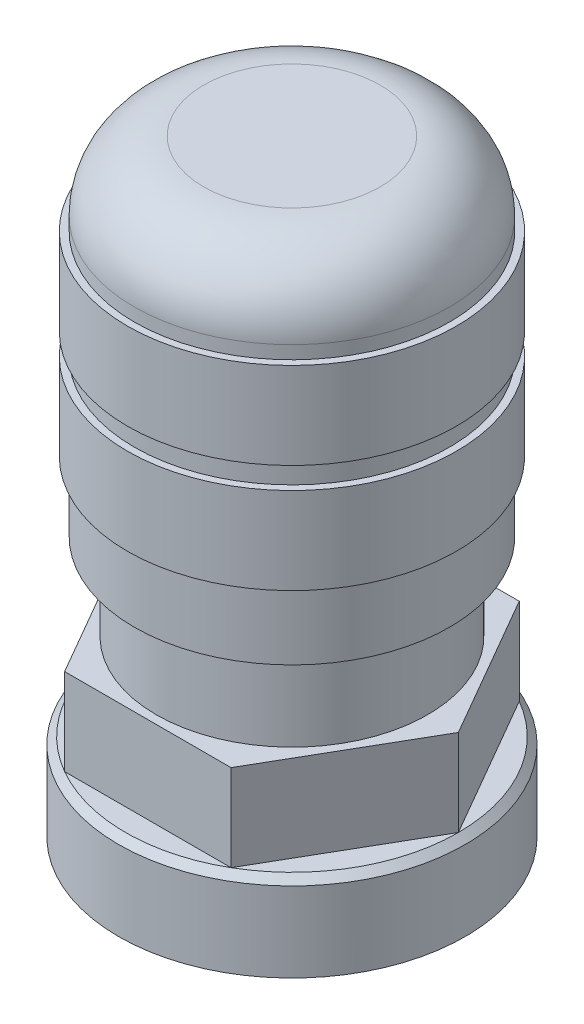
ISO-10303-21;
HEADER;
FILE_DESCRIPTION(('STEP AP214'),'2;1');
FILE_NAME('part.step','',(''),(''),'','','');
FILE_SCHEMA(('AUTOMOTIVE_DESIGN { 1 0 10303 214 1 1 1 1 }'));
ENDSEC;
DATA;
#1=APPLICATION_CONTEXT('core data for automotive mechanical design processes');
#2=APPLICATION_PROTOCOL_DEFINITION('international standard','automotive_design',2000,#1);
#3=PRODUCT_CONTEXT('',#1,'mechanical');
#4=PRODUCT('Part','Part','',(#3));
#5=PRODUCT_RELATED_PRODUCT_CATEGORY('part','',(#4));
#6=PRODUCT_DEFINITION_FORMATION('','',#4);
#7=PRODUCT_DEFINITION_CONTEXT('part definition',#1,'design');
#8=PRODUCT_DEFINITION('design','',#6,#7);
#9=PRODUCT_DEFINITION_SHAPE('','',#8);
#10=(LENGTH_UNIT() NAMED_UNIT(*) SI_UNIT(.MILLI.,.METRE.));
#11=(NAMED_UNIT(*) PLANE_ANGLE_UNIT() SI_UNIT($,.RADIAN.));
#12=(NAMED_UNIT(*) SI_UNIT($,.STERADIAN.) SOLID_ANGLE_UNIT());
#13=UNCERTAINTY_MEASURE_WITH_UNIT(LENGTH_MEASURE(1.E-05),#10,'distance_accuracy_value','');
#14=(GEOMETRIC_REPRESENTATION_CONTEXT(3) GLOBAL_UNCERTAINTY_ASSIGNED_CONTEXT((#13)) GLOBAL_UNIT_ASSIGNED_CONTEXT((#10,
#11,#12)) REPRESENTATION_CONTEXT('',''));
#15=CARTESIAN_POINT('',(0.,0.,0.));
#16=DIRECTION('',(0.,0.,1.));
#17=DIRECTION('',(1.,0.,0.));
#18=AXIS2_PLACEMENT_3D('',#15,#16,#17);
#19=CARTESIAN_POINT('',(0.,17.78,3.23260615340587));
#20=DIRECTION('',(0.,-1.,0.));
#21=DIRECTION('',(0.,0.,-1.));
#22=AXIS2_PLACEMENT_3D('',#19,#20,#21);
#23=PLANE('',#22);
#24=CARTESIAN_POINT('',(0.,17.78,0.));
#25=DIRECTION('',(0.,1.,0.));
#26=DIRECTION('',(0.,0.,1.));
#27=AXIS2_PLACEMENT_3D('',#24,#25,#26);
#28=CIRCLE('',#27,3.23260615340587);
#29=CARTESIAN_POINT('',(0.,17.78,3.23260615340587));
#30=VERTEX_POINT('',#29);
#31=EDGE_CURVE('E223',#30,#30,#28,.T.);
#32=ORIENTED_EDGE('',*,*,#31,.F.);
#33=EDGE_LOOP('',(#32));
#34=FACE_BOUND('',#33,.T.);
#35=ADVANCED_FACE('F36',(#34),#23,.T.);
#36=CARTESIAN_POINT('',(0.,16.51,0.));
#37=DIRECTION('',(0.,1.,0.));
#38=DIRECTION('',(0.,0.,1.));
#39=AXIS2_PLACEMENT_3D('',#36,#37,#38);
#40=TOROIDAL_SURFACE('',#39,3.23260615340588,1.27);
#41=ORIENTED_EDGE('',*,*,#31,.T.);
#42=EDGE_LOOP('',(#41));
#43=FACE_BOUND('',#42,.T.);
#44=CARTESIAN_POINT('',(0.,16.51,0.));
#45=DIRECTION('',(0.,1.,0.));
#46=DIRECTION('',(0.,0.,1.));
#47=AXIS2_PLACEMENT_3D('',#44,#45,#46);
#48=CIRCLE('',#47,4.50260615340587);
#49=CARTESIAN_POINT('',(0.,16.51,4.50260615340587));
#50=VERTEX_POINT('',#49);
#51=EDGE_CURVE('E226',#50,#50,#48,.T.);
#52=ORIENTED_EDGE('',*,*,#51,.F.);
#53=EDGE_LOOP('',(#52));
#54=FACE_BOUND('',#53,.T.);
#55=ADVANCED_FACE('F283',(#43,#54),#40,.F.);
#56=CARTESIAN_POINT('',(0.,20.1696110132445,0.));
#57=DIRECTION('',(0.,1.,0.));
#58=DIRECTION('',(0.,0.,1.));
#59=AXIS2_PLACEMENT_3D('',#56,#57,#58);
#60=CYLINDRICAL_SURFACE('',#59,4.50260615340587);
#61=ORIENTED_EDGE('',*,*,#51,.T.);
#62=EDGE_LOOP('',(#61));
#63=FACE_BOUND('',#62,.T.);
#64=CARTESIAN_POINT('',(0.,14.7612001787416,0.));
#65=DIRECTION('',(0.,1.,0.));
#66=DIRECTION('',(0.,0.,1.));
#67=AXIS2_PLACEMENT_3D('',#64,#65,#66);
#68=CIRCLE('',#67,4.50260615340587);
#69=CARTESIAN_POINT('',(0.,14.7612001787416,4.50260615340587));
#70=VERTEX_POINT('',#69);
#71=EDGE_CURVE('E229',#70,#70,#68,.T.);
#72=ORIENTED_EDGE('',*,*,#71,.F.);
#73=EDGE_LOOP('',(#72));
#74=FACE_BOUND('',#73,.T.);
#75=ADVANCED_FACE('F289',(#63,#74),#60,.F.);
#76=CARTESIAN_POINT('',(0.,14.7612001787416,4.75660615340588));
#77=DIRECTION('',(0.,-1.,0.));
#78=DIRECTION('',(0.,0.,-1.));
#79=AXIS2_PLACEMENT_3D('',#76,#77,#78);
#80=PLANE('',#79);
#81=ORIENTED_EDGE('',*,*,#71,.T.);
#82=EDGE_LOOP('',(#81));
#83=FACE_BOUND('',#82,.T.);
#84=CARTESIAN_POINT('',(0.,14.7612001787416,0.));
#85=DIRECTION('',(0.,1.,0.));
#86=DIRECTION('',(0.,0.,1.));
#87=AXIS2_PLACEMENT_3D('',#84,#85,#86);
#88=CIRCLE('',#87,4.75660615340588);
#89=CARTESIAN_POINT('',(0.,14.7612001787416,4.75660615340588));
#90=VERTEX_POINT('',#89);
#91=EDGE_CURVE('E232',#90,#90,#88,.T.);
#92=ORIENTED_EDGE('',*,*,#91,.F.);
#93=EDGE_LOOP('',(#92));
#94=FACE_BOUND('',#93,.T.);
#95=ADVANCED_FACE('F462',(#83,#94),#80,.T.);
#96=CARTESIAN_POINT('',(0.,20.1696110132445,0.));
#97=DIRECTION('',(0.,1.,0.));
#98=DIRECTION('',(0.,0.,1.));
#99=AXIS2_PLACEMENT_3D('',#96,#97,#98);
#100=CYLINDRICAL_SURFACE('',#99,4.75660615340588);
#101=ORIENTED_EDGE('',*,*,#91,.T.);
#102=EDGE_LOOP('',(#101));
#103=FACE_BOUND('',#102,.T.);
#104=CARTESIAN_POINT('',(0.,14.1262001787416,0.));
#105=DIRECTION('',(0.,1.,0.));
#106=DIRECTION('',(0.,0.,1.));
#107=AXIS2_PLACEMENT_3D('',#104,#105,#106);
#108=CIRCLE('',#107,4.75660615340588);
#109=CARTESIAN_POINT('',(0.,14.1262001787416,4.75660615340588));
#110=VERTEX_POINT('',#109);
#111=EDGE_CURVE('E235',#110,#110,#108,.T.);
#112=ORIENTED_EDGE('',*,*,#111,.F.);
#113=EDGE_LOOP('',(#112));
#114=FACE_BOUND('',#113,.T.);
#115=ADVANCED_FACE('F452',(#103,#114),#100,.F.);
#116=CARTESIAN_POINT('',(0.,14.1262001787416,4.50260615340587));
#117=DIRECTION('',(0.,1.,0.));
#118=DIRECTION('',(0.,0.,1.));
#119=AXIS2_PLACEMENT_3D('',#116,#117,#118);
#120=PLANE('',#119);
#121=ORIENTED_EDGE('',*,*,#111,.T.);
#122=EDGE_LOOP('',(#121));
#123=FACE_BOUND('',#122,.T.);
#124=CARTESIAN_POINT('',(0.,14.1262001787416,0.));
#125=DIRECTION('',(0.,1.,0.));
#126=DIRECTION('',(0.,0.,1.));
#127=AXIS2_PLACEMENT_3D('',#124,#125,#126);
#128=CIRCLE('',#127,4.50260615340587);
#129=CARTESIAN_POINT('',(0.,14.1262001787416,4.50260615340587));
#130=VERTEX_POINT('',#129);
#131=EDGE_CURVE('E238',#130,#130,#128,.T.);
#132=ORIENTED_EDGE('',*,*,#131,.F.);
#133=EDGE_LOOP('',(#132));
#134=FACE_BOUND('',#133,.T.);
#135=ADVANCED_FACE('F442',(#123,#134),#120,.T.);
#136=CARTESIAN_POINT('',(0.,20.1696110132445,0.));
#137=DIRECTION('',(0.,1.,0.));
#138=DIRECTION('',(0.,0.,1.));
#139=AXIS2_PLACEMENT_3D('',#136,#137,#138);
#140=CYLINDRICAL_SURFACE('',#139,4.50260615340587);
#141=ORIENTED_EDGE('',*,*,#131,.T.);
#142=EDGE_LOOP('',(#141));
#143=FACE_BOUND('',#142,.T.);
#144=CARTESIAN_POINT('',(0.,10.7924501787416,0.));
#145=DIRECTION('',(0.,1.,0.));
#146=DIRECTION('',(0.,0.,1.));
#147=AXIS2_PLACEMENT_3D('',#144,#145,#146);
#148=CIRCLE('',#147,4.50260615340587);
#149=CARTESIAN_POINT('',(0.,10.7924501787416,4.50260615340587));
#150=VERTEX_POINT('',#149);
#151=EDGE_CURVE('E241',#150,#150,#148,.T.);
#152=ORIENTED_EDGE('',*,*,#151,.F.);
#153=EDGE_LOOP('',(#152));
#154=FACE_BOUND('',#153,.T.);
#155=ADVANCED_FACE('F432',(#143,#154),#140,.F.);
#156=CARTESIAN_POINT('',(0.,10.7924501787416,4.75660615340588));
#157=DIRECTION('',(0.,-1.,0.));
#158=DIRECTION('',(0.,0.,-1.));
#159=AXIS2_PLACEMENT_3D('',#156,#157,#158);
#160=PLANE('',#159);
#161=ORIENTED_EDGE('',*,*,#151,.T.);
#162=EDGE_LOOP('',(#161));
#163=FACE_BOUND('',#162,.T.);
#164=CARTESIAN_POINT('',(0.,10.7924501787416,0.));
#165=DIRECTION('',(0.,1.,0.));
#166=DIRECTION('',(0.,0.,1.));
#167=AXIS2_PLACEMENT_3D('',#164,#165,#166);
#168=CIRCLE('',#167,4.75660615340588);
#169=CARTESIAN_POINT('',(0.,10.7924501787416,4.75660615340588));
#170=VERTEX_POINT('',#169);
#171=EDGE_CURVE('E244',#170,#170,#168,.T.);
#172=ORIENTED_EDGE('',*,*,#171,.F.);
#173=EDGE_LOOP('',(#172));
#174=FACE_BOUND('',#173,.T.);
#175=ADVANCED_FACE('F422',(#163,#174),#160,.T.);
#176=CARTESIAN_POINT('',(0.,20.1696110132445,0.));
#177=DIRECTION('',(0.,1.,0.));
#178=DIRECTION('',(0.,0.,1.));
#179=AXIS2_PLACEMENT_3D('',#176,#177,#178);
#180=CYLINDRICAL_SURFACE('',#179,4.75660615340588);
#181=ORIENTED_EDGE('',*,*,#171,.T.);
#182=EDGE_LOOP('',(#181));
#183=FACE_BOUND('',#182,.T.);
#184=CARTESIAN_POINT('',(0.,10.1574501787416,0.));
#185=DIRECTION('',(0.,1.,0.));
#186=DIRECTION('',(0.,0.,1.));
#187=AXIS2_PLACEMENT_3D('',#184,#185,#186);
#188=CIRCLE('',#187,4.75660615340588);
#189=CARTESIAN_POINT('',(0.,10.1574501787416,4.75660615340588));
#190=VERTEX_POINT('',#189);
#191=EDGE_CURVE('E247',#190,#190,#188,.T.);
#192=ORIENTED_EDGE('',*,*,#191,.F.);
#193=EDGE_LOOP('',(#192));
#194=FACE_BOUND('',#193,.T.);
#195=ADVANCED_FACE('F279',(#183,#194),#180,.F.);
#196=CARTESIAN_POINT('',(0.,10.1574501787416,4.50260615340587));
#197=DIRECTION('',(0.,1.,0.));
#198=DIRECTION('',(0.,0.,1.));
#199=AXIS2_PLACEMENT_3D('',#196,#197,#198);
#200=PLANE('',#199);
#201=ORIENTED_EDGE('',*,*,#191,.T.);
#202=EDGE_LOOP('',(#201));
#203=FACE_BOUND('',#202,.T.);
#204=CARTESIAN_POINT('',(0.,10.1574501787416,0.));
#205=DIRECTION('',(0.,1.,0.));
#206=DIRECTION('',(0.,0.,1.));
#207=AXIS2_PLACEMENT_3D('',#204,#205,#206);
#208=CIRCLE('',#207,4.50260615340587);
#209=CARTESIAN_POINT('',(0.,10.1574501787416,4.50260615340587));
#210=VERTEX_POINT('',#209);
#211=EDGE_CURVE('E250',#210,#210,#208,.T.);
#212=ORIENTED_EDGE('',*,*,#211,.F.);
#213=EDGE_LOOP('',(#212));
#214=FACE_BOUND('',#213,.T.);
#215=ADVANCED_FACE('F273',(#203,#214),#200,.T.);
#216=CARTESIAN_POINT('',(0.,20.1696110132445,0.));
#217=DIRECTION('',(0.,1.,0.));
#218=DIRECTION('',(0.,0.,1.));
#219=AXIS2_PLACEMENT_3D('',#216,#217,#218);
#220=CYLINDRICAL_SURFACE('',#219,4.50260615340587);
#221=ORIENTED_EDGE('',*,*,#211,.T.);
#222=EDGE_LOOP('',(#221));
#223=FACE_BOUND('',#222,.T.);
#224=CARTESIAN_POINT('',(0.,7.62,0.));
#225=DIRECTION('',(0.,1.,0.));
#226=DIRECTION('',(0.,0.,1.));
#227=AXIS2_PLACEMENT_3D('',#224,#225,#226);
#228=CIRCLE('',#227,4.50260615340587);
#229=CARTESIAN_POINT('',(0.,7.62,4.50260615340587));
#230=VERTEX_POINT('',#229);
#231=EDGE_CURVE('E253',#230,#230,#228,.T.);
#232=ORIENTED_EDGE('',*,*,#231,.F.);
#233=EDGE_LOOP('',(#232));
#234=FACE_BOUND('',#233,.T.);
#235=ADVANCED_FACE('F268',(#223,#234),#220,.F.);
#236=CARTESIAN_POINT('',(0.,7.62,3.70229944016029));
#237=DIRECTION('',(0.,1.,0.));
#238=DIRECTION('',(0.,0.,1.));
#239=AXIS2_PLACEMENT_3D('',#236,#237,#238);
#240=PLANE('',#239);
#241=CARTESIAN_POINT('',(0.,7.62,0.));
#242=DIRECTION('',(0.,1.,0.));
#243=DIRECTION('',(0.,0.,1.));
#244=AXIS2_PLACEMENT_3D('',#241,#242,#243);
#245=CIRCLE('',#244,3.96875);
#246=CARTESIAN_POINT('',(0.,7.62,3.96875));
#247=VERTEX_POINT('',#246);
#248=EDGE_CURVE('E40',#247,#247,#245,.T.);
#249=ORIENTED_EDGE('',*,*,#248,.F.);
#250=EDGE_LOOP('',(#249));
#251=FACE_BOUND('',#250,.T.);
#252=ORIENTED_EDGE('',*,*,#231,.T.);
#253=EDGE_LOOP('',(#252));
#254=FACE_BOUND('',#253,.T.);
#255=ADVANCED_FACE('F265',(#251,#254),#240,.T.);
#256=CARTESIAN_POINT('',(0.,9.525,0.));
#257=DIRECTION('',(0.,-1.,0.));
#258=DIRECTION('',(0.,0.,-1.));
#259=AXIS2_PLACEMENT_3D('',#256,#257,#258);
#260=CYLINDRICAL_SURFACE('',#259,3.96875);
#261=ORIENTED_EDGE('',*,*,#248,.T.);
#262=EDGE_LOOP('',(#261));
#263=FACE_BOUND('',#262,.T.);
#264=CARTESIAN_POINT('',(0.,-3.175,0.));
#265=DIRECTION('',(0.,-1.,0.));
#266=DIRECTION('',(0.,0.,-1.));
#267=AXIS2_PLACEMENT_3D('',#264,#265,#266);
#268=CIRCLE('',#267,3.96875);
#269=CARTESIAN_POINT('',(0.,-3.175,-3.96875));
#270=VERTEX_POINT('',#269);
#271=EDGE_CURVE('E256',#270,#270,#268,.T.);
#272=ORIENTED_EDGE('',*,*,#271,.T.);
#273=EDGE_LOOP('',(#272));
#274=FACE_BOUND('',#273,.T.);
#275=ADVANCED_FACE('F263',(#263,#274),#260,.F.);
#276=CARTESIAN_POINT('',(0.,0.,0.));
#277=DIRECTION('',(0.,1.,0.));
#278=DIRECTION('',(0.,0.,1.));
#279=AXIS2_PLACEMENT_3D('',#276,#277,#278);
#280=PLANE('',#279);
#281=DIRECTION('',(0.499999999999995,0.,-0.866025403784442));
#282=VECTOR('',#281,1.);
#283=CARTESIAN_POINT('',(3.04800000000006,0.,5.2792908614699));
#284=LINE('',#283,#282);
#285=CARTESIAN_POINT('',(3.04800000000006,0.,5.2792908614699));
#286=VERTEX_POINT('',#285);
#287=CARTESIAN_POINT('',(6.096,0.,0.));
#288=VERTEX_POINT('',#287);
#289=EDGE_CURVE('E115',#286,#288,#284,.T.);
#290=ORIENTED_EDGE('',*,*,#289,.F.);
#291=CARTESIAN_POINT('',(0.,0.,0.));
#292=DIRECTION('',(0.,1.,0.));
#293=DIRECTION('',(0.,0.,1.));
#294=AXIS2_PLACEMENT_3D('',#291,#292,#293);
#295=CIRCLE('',#294,6.096);
#296=EDGE_CURVE('E125',#286,#288,#295,.T.);
#297=ORIENTED_EDGE('',*,*,#296,.T.);
#298=EDGE_LOOP('',(#290,#297));
#299=FACE_BOUND('',#298,.T.);
#300=ADVANCED_FACE('F367',(#299),#280,.T.);
#301=DIRECTION('',(1.,0.,0.));
#302=VECTOR('',#301,1.);
#303=CARTESIAN_POINT('',(-3.04799999999995,0.,5.27929086146997));
#304=LINE('',#303,#302);
#305=CARTESIAN_POINT('',(-3.04799999999995,0.,5.27929086146997));
#306=VERTEX_POINT('',#305);
#307=EDGE_CURVE('E51',#306,#286,#304,.T.);
#308=ORIENTED_EDGE('',*,*,#307,.F.);
#309=EDGE_CURVE('E119',#306,#286,#295,.T.);
#310=ORIENTED_EDGE('',*,*,#309,.T.);
#311=EDGE_LOOP('',(#308,#310));
#312=FACE_BOUND('',#311,.T.);
#313=ADVANCED_FACE('F382',(#312),#280,.T.);
#314=DIRECTION('',(0.500000000000007,0.,0.866025403784435));
#315=VECTOR('',#314,1.);
#316=CARTESIAN_POINT('',(-6.096,0.,0.));
#317=LINE('',#316,#315);
#318=CARTESIAN_POINT('',(-6.096,0.,0.));
#319=VERTEX_POINT('',#318);
#320=EDGE_CURVE('E58',#319,#306,#317,.T.);
#321=ORIENTED_EDGE('',*,*,#320,.F.);
#322=EDGE_CURVE('E387',#319,#306,#295,.T.);
#323=ORIENTED_EDGE('',*,*,#322,.T.);
#324=EDGE_LOOP('',(#321,#323));
#325=FACE_BOUND('',#324,.T.);
#326=ADVANCED_FACE('F377',(#325),#280,.T.);
#327=DIRECTION('',(-0.499999999999995,0.,0.866025403784442));
#328=VECTOR('',#327,1.);
#329=CARTESIAN_POINT('',(-3.04800000000002,0.,-5.27929086146992));
#330=LINE('',#329,#328);
#331=CARTESIAN_POINT('',(-3.04800000000002,0.,-5.27929086146992));
#332=VERTEX_POINT('',#331);
#333=EDGE_CURVE('E164',#332,#319,#330,.T.);
#334=ORIENTED_EDGE('',*,*,#333,.F.);
#335=EDGE_CURVE('E385',#332,#319,#295,.T.);
#336=ORIENTED_EDGE('',*,*,#335,.T.);
#337=EDGE_LOOP('',(#334,#336));
#338=FACE_BOUND('',#337,.T.);
#339=ADVANCED_FACE('F373',(#338),#280,.T.);
#340=DIRECTION('',(-1.,0.,0.));
#341=VECTOR('',#340,1.);
#342=CARTESIAN_POINT('',(3.04799999999999,0.,-5.27929086146994));
#343=LINE('',#342,#341);
#344=CARTESIAN_POINT('',(3.04799999999999,0.,-5.27929086146994));
#345=VERTEX_POINT('',#344);
#346=EDGE_CURVE('E170',#345,#332,#343,.T.);
#347=ORIENTED_EDGE('',*,*,#346,.F.);
#348=EDGE_CURVE('E386',#345,#332,#295,.T.);
#349=ORIENTED_EDGE('',*,*,#348,.T.);
#350=EDGE_LOOP('',(#347,#349));
#351=FACE_BOUND('',#350,.T.);
#352=ADVANCED_FACE('F368',(#351),#280,.T.);
#353=CARTESIAN_POINT('',(0.,-3.175,0.));
#354=DIRECTION('',(0.,1.,0.));
#355=DIRECTION('',(0.,0.,1.));
#356=AXIS2_PLACEMENT_3D('',#353,#354,#355);
#357=CYLINDRICAL_SURFACE('',#356,6.35);
#358=CARTESIAN_POINT('',(0.,-0.254000000000002,0.));
#359=DIRECTION('',(0.,1.,0.));
#360=DIRECTION('',(0.,0.,1.));
#361=AXIS2_PLACEMENT_3D('',#358,#359,#360);
#362=CIRCLE('',#361,6.35);
#363=CARTESIAN_POINT('',(0.,-0.254000000000002,6.35));
#364=VERTEX_POINT('',#363);
#365=EDGE_CURVE('E45',#364,#364,#362,.F.);
#366=ORIENTED_EDGE('',*,*,#365,.T.);
#367=EDGE_LOOP('',(#366));
#368=FACE_BOUND('',#367,.T.);
#369=CARTESIAN_POINT('',(0.,-3.175,0.));
#370=DIRECTION('',(0.,1.,0.));
#371=DIRECTION('',(0.,0.,1.));
#372=AXIS2_PLACEMENT_3D('',#369,#370,#371);
#373=CIRCLE('',#372,6.35);
#374=CARTESIAN_POINT('',(0.,-3.175,6.35));
#375=VERTEX_POINT('',#374);
#376=EDGE_CURVE('E116',#375,#375,#373,.T.);
#377=ORIENTED_EDGE('',*,*,#376,.T.);
#378=EDGE_LOOP('',(#377));
#379=FACE_BOUND('',#378,.T.);
#380=ADVANCED_FACE('F132',(#368,#379),#357,.T.);
#381=CARTESIAN_POINT('',(0.,-3.175,0.));
#382=DIRECTION('',(0.,1.,0.));
#383=DIRECTION('',(0.,0.,1.));
#384=AXIS2_PLACEMENT_3D('',#381,#382,#383);
#385=PLANE('',#384);
#386=ORIENTED_EDGE('',*,*,#271,.F.);
#387=EDGE_LOOP('',(#386));
#388=FACE_BOUND('',#387,.T.);
#389=ORIENTED_EDGE('',*,*,#376,.F.);
#390=EDGE_LOOP('',(#389));
#391=FACE_BOUND('',#390,.T.);
#392=ADVANCED_FACE('F361',(#388,#391),#385,.F.);
#393=DIRECTION('',(-0.500000000000001,0.,-0.866025403784438));
#394=VECTOR('',#393,1.);
#395=CARTESIAN_POINT('',(6.096,0.,0.));
#396=LINE('',#395,#394);
#397=EDGE_CURVE('E173',#288,#345,#396,.T.);
#398=ORIENTED_EDGE('',*,*,#397,.F.);
#399=EDGE_CURVE('E128',#288,#345,#295,.T.);
#400=ORIENTED_EDGE('',*,*,#399,.T.);
#401=EDGE_LOOP('',(#398,#400));
#402=FACE_BOUND('',#401,.T.);
#403=ADVANCED_FACE('F137',(#402),#280,.T.);
#404=CARTESIAN_POINT('',(0.,0.,0.));
#405=DIRECTION('',(0.,-1.,0.));
#406=DIRECTION('',(0.,0.,-1.));
#407=AXIS2_PLACEMENT_3D('',#404,#405,#406);
#408=CONICAL_SURFACE('',#407,6.096,0.785398163397443);
#409=ORIENTED_EDGE('',*,*,#365,.F.);
#410=EDGE_LOOP('',(#409));
#411=FACE_BOUND('',#410,.T.);
#412=ORIENTED_EDGE('',*,*,#296,.F.);
#413=ORIENTED_EDGE('',*,*,#309,.F.);
#414=ORIENTED_EDGE('',*,*,#322,.F.);
#415=ORIENTED_EDGE('',*,*,#335,.F.);
#416=ORIENTED_EDGE('',*,*,#348,.F.);
#417=ORIENTED_EDGE('',*,*,#399,.F.);
#418=EDGE_LOOP('',(#412,#413,#414,#415,#416,#417));
#419=FACE_BOUND('',#418,.T.);
#420=ADVANCED_FACE('F38',(#411,#419),#408,.T.);
#421=CARTESIAN_POINT('',(3.04800000000006,3.175,5.2792908614699));
#422=DIRECTION('',(-0.866025403784441,0.,-0.499999999999995));
#423=DIRECTION('',(-0.499999999999995,0.,0.866025403784442));
#424=AXIS2_PLACEMENT_3D('',#421,#422,#423);
#425=PLANE('',#424);
#426=ORIENTED_EDGE('',*,*,#289,.T.);
#427=DIRECTION('',(0.,-1.,0.));
#428=VECTOR('',#427,1.);
#429=CARTESIAN_POINT('',(6.096,3.175,0.));
#430=LINE('',#429,#428);
#431=CARTESIAN_POINT('',(6.096,3.175,0.));
#432=VERTEX_POINT('',#431);
#433=EDGE_CURVE('E97',#432,#288,#430,.T.);
#434=ORIENTED_EDGE('',*,*,#433,.F.);
#435=DIRECTION('',(0.499999999999995,0.,-0.866025403784442));
#436=VECTOR('',#435,1.);
#437=CARTESIAN_POINT('',(3.04800000000006,3.175,5.2792908614699));
#438=LINE('',#437,#436);
#439=CARTESIAN_POINT('',(3.04800000000006,3.175,5.2792908614699));
#440=VERTEX_POINT('',#439);
#441=EDGE_CURVE('E104',#440,#432,#438,.T.);
#442=ORIENTED_EDGE('',*,*,#441,.F.);
#443=DIRECTION('',(0.,-1.,0.));
#444=VECTOR('',#443,1.);
#445=CARTESIAN_POINT('',(3.04800000000006,3.175,5.2792908614699));
#446=LINE('',#445,#444);
#447=EDGE_CURVE('E145',#440,#286,#446,.T.);
#448=ORIENTED_EDGE('',*,*,#447,.T.);
#449=EDGE_LOOP('',(#426,#434,#442,#448));
#450=FACE_BOUND('',#449,.T.);
#451=ADVANCED_FACE('F114',(#450),#425,.F.);
#452=CARTESIAN_POINT('',(6.096,3.175,0.));
#453=DIRECTION('',(-0.866025403784438,0.,0.500000000000001));
#454=DIRECTION('',(0.500000000000001,0.,0.866025403784438));
#455=AXIS2_PLACEMENT_3D('',#452,#453,#454);
#456=PLANE('',#455);
#457=ORIENTED_EDGE('',*,*,#397,.T.);
#458=DIRECTION('',(0.,-1.,0.));
#459=VECTOR('',#458,1.);
#460=CARTESIAN_POINT('',(3.04799999999999,3.175,-5.27929086146994));
#461=LINE('',#460,#459);
#462=CARTESIAN_POINT('',(3.04799999999999,3.175,-5.27929086146994));
#463=VERTEX_POINT('',#462);
#464=EDGE_CURVE('E100',#463,#345,#461,.T.);
#465=ORIENTED_EDGE('',*,*,#464,.F.);
#466=DIRECTION('',(-0.500000000000001,0.,-0.866025403784438));
#467=VECTOR('',#466,1.);
#468=CARTESIAN_POINT('',(6.096,3.175,0.));
#469=LINE('',#468,#467);
#470=EDGE_CURVE('E92',#432,#463,#469,.T.);
#471=ORIENTED_EDGE('',*,*,#470,.F.);
#472=ORIENTED_EDGE('',*,*,#433,.T.);
#473=EDGE_LOOP('',(#457,#465,#471,#472));
#474=FACE_BOUND('',#473,.T.);
#475=ADVANCED_FACE('F95',(#474),#456,.F.);
#476=CARTESIAN_POINT('',(3.04799999999999,3.175,-5.27929086146994));
#477=DIRECTION('',(0.,0.,1.));
#478=DIRECTION('',(1.,0.,0.));
#479=AXIS2_PLACEMENT_3D('',#476,#477,#478);
#480=PLANE('',#479);
#481=ORIENTED_EDGE('',*,*,#346,.T.);
#482=DIRECTION('',(0.,-1.,0.));
#483=VECTOR('',#482,1.);
#484=CARTESIAN_POINT('',(-3.04800000000002,3.175,-5.27929086146992));
#485=LINE('',#484,#483);
#486=CARTESIAN_POINT('',(-3.04800000000002,3.175,-5.27929086146992));
#487=VERTEX_POINT('',#486);
#488=EDGE_CURVE('E121',#487,#332,#485,.T.);
#489=ORIENTED_EDGE('',*,*,#488,.F.);
#490=DIRECTION('',(-1.,0.,0.));
#491=VECTOR('',#490,1.);
#492=CARTESIAN_POINT('',(3.04799999999999,3.175,-5.27929086146994));
#493=LINE('',#492,#491);
#494=EDGE_CURVE('E103',#463,#487,#493,.T.);
#495=ORIENTED_EDGE('',*,*,#494,.F.);
#496=ORIENTED_EDGE('',*,*,#464,.T.);
#497=EDGE_LOOP('',(#481,#489,#495,#496));
#498=FACE_BOUND('',#497,.T.);
#499=ADVANCED_FACE('F168',(#498),#480,.F.);
#500=CARTESIAN_POINT('',(-3.04800000000002,3.175,-5.27929086146992));
#501=DIRECTION('',(0.866025403784441,0.,0.499999999999995));
#502=DIRECTION('',(0.499999999999995,0.,-0.866025403784442));
#503=AXIS2_PLACEMENT_3D('',#500,#501,#502);
#504=PLANE('',#503);
#505=ORIENTED_EDGE('',*,*,#333,.T.);
#506=DIRECTION('',(0.,-1.,0.));
#507=VECTOR('',#506,1.);
#508=CARTESIAN_POINT('',(-6.096,3.175,0.));
#509=LINE('',#508,#507);
#510=CARTESIAN_POINT('',(-6.096,3.175,0.));
#511=VERTEX_POINT('',#510);
#512=EDGE_CURVE('E150',#511,#319,#509,.T.);
#513=ORIENTED_EDGE('',*,*,#512,.F.);
#514=DIRECTION('',(-0.499999999999995,0.,0.866025403784442));
#515=VECTOR('',#514,1.);
#516=CARTESIAN_POINT('',(-3.04800000000002,3.175,-5.27929086146992));
#517=LINE('',#516,#515);
#518=EDGE_CURVE('E165',#487,#511,#517,.T.);
#519=ORIENTED_EDGE('',*,*,#518,.F.);
#520=ORIENTED_EDGE('',*,*,#488,.T.);
#521=EDGE_LOOP('',(#505,#513,#519,#520));
#522=FACE_BOUND('',#521,.T.);
#523=ADVANCED_FACE('F162',(#522),#504,.F.);
#524=CARTESIAN_POINT('',(-6.096,3.175,0.));
#525=DIRECTION('',(0.866025403784434,0.,-0.500000000000007));
#526=DIRECTION('',(-0.500000000000007,0.,-0.866025403784435));
#527=AXIS2_PLACEMENT_3D('',#524,#525,#526);
#528=PLANE('',#527);
#529=ORIENTED_EDGE('',*,*,#320,.T.);
#530=DIRECTION('',(0.,-1.,0.));
#531=VECTOR('',#530,1.);
#532=CARTESIAN_POINT('',(-3.04799999999995,3.175,5.27929086146997));
#533=LINE('',#532,#531);
#534=CARTESIAN_POINT('',(-3.04799999999995,3.175,5.27929086146997));
#535=VERTEX_POINT('',#534);
#536=EDGE_CURVE('E147',#535,#306,#533,.T.);
#537=ORIENTED_EDGE('',*,*,#536,.F.);
#538=DIRECTION('',(0.500000000000007,0.,0.866025403784435));
#539=VECTOR('',#538,1.);
#540=CARTESIAN_POINT('',(-6.096,3.175,0.));
#541=LINE('',#540,#539);
#542=EDGE_CURVE('E152',#511,#535,#541,.T.);
#543=ORIENTED_EDGE('',*,*,#542,.F.);
#544=ORIENTED_EDGE('',*,*,#512,.T.);
#545=EDGE_LOOP('',(#529,#537,#543,#544));
#546=FACE_BOUND('',#545,.T.);
#547=ADVANCED_FACE('F179',(#546),#528,.F.);
#548=CARTESIAN_POINT('',(-3.04799999999995,3.175,5.27929086146997));
#549=DIRECTION('',(0.,0.,-1.));
#550=DIRECTION('',(-1.,0.,0.));
#551=AXIS2_PLACEMENT_3D('',#548,#549,#550);
#552=PLANE('',#551);
#553=ORIENTED_EDGE('',*,*,#307,.T.);
#554=ORIENTED_EDGE('',*,*,#447,.F.);
#555=DIRECTION('',(1.,0.,0.));
#556=VECTOR('',#555,1.);
#557=CARTESIAN_POINT('',(-3.04799999999995,3.175,5.27929086146997));
#558=LINE('',#557,#556);
#559=EDGE_CURVE('E109',#535,#440,#558,.T.);
#560=ORIENTED_EDGE('',*,*,#559,.F.);
#561=ORIENTED_EDGE('',*,*,#536,.T.);
#562=EDGE_LOOP('',(#553,#554,#560,#561));
#563=FACE_BOUND('',#562,.T.);
#564=ADVANCED_FACE('F144',(#563),#552,.F.);
#565=CARTESIAN_POINT('',(6.096,3.175,0.));
#566=DIRECTION('',(0.,1.,0.));
#567=DIRECTION('',(0.,0.,1.));
#568=AXIS2_PLACEMENT_3D('',#565,#566,#567);
#569=PLANE('',#568);
#570=CARTESIAN_POINT('',(0.,3.175,0.));
#571=DIRECTION('',(0.,1.,0.));
#572=DIRECTION('',(0.,0.,1.));
#573=AXIS2_PLACEMENT_3D('',#570,#571,#572);
#574=CIRCLE('',#573,4.97229944016029);
#575=CARTESIAN_POINT('',(0.,3.175,4.97229944016029));
#576=VERTEX_POINT('',#575);
#577=EDGE_CURVE('E11',#576,#576,#574,.T.);
#578=ORIENTED_EDGE('',*,*,#577,.F.);
#579=EDGE_LOOP('',(#578));
#580=FACE_BOUND('',#579,.T.);
#581=ORIENTED_EDGE('',*,*,#441,.T.);
#582=ORIENTED_EDGE('',*,*,#470,.T.);
#583=ORIENTED_EDGE('',*,*,#494,.T.);
#584=ORIENTED_EDGE('',*,*,#518,.T.);
#585=ORIENTED_EDGE('',*,*,#542,.T.);
#586=ORIENTED_EDGE('',*,*,#559,.T.);
#587=EDGE_LOOP('',(#581,#582,#583,#584,#585,#586));
#588=FACE_BOUND('',#587,.T.);
#589=ADVANCED_FACE('F107',(#580,#588),#569,.T.);
#590=CARTESIAN_POINT('',(0.,20.1696110132445,0.));
#591=DIRECTION('',(0.,1.,0.));
#592=DIRECTION('',(0.,0.,1.));
#593=AXIS2_PLACEMENT_3D('',#590,#591,#592);
#594=CYLINDRICAL_SURFACE('',#593,4.97229944016029);
#595=ORIENTED_EDGE('',*,*,#577,.T.);
#596=EDGE_LOOP('',(#595));
#597=FACE_BOUND('',#596,.T.);
#598=CARTESIAN_POINT('',(0.,6.35,0.));
#599=DIRECTION('',(0.,1.,0.));
#600=DIRECTION('',(0.,0.,1.));
#601=AXIS2_PLACEMENT_3D('',#598,#599,#600);
#602=CIRCLE('',#601,4.97229944016029);
#603=CARTESIAN_POINT('',(0.,6.35,4.97229944016029));
#604=VERTEX_POINT('',#603);
#605=EDGE_CURVE('E184',#604,#604,#602,.T.);
#606=ORIENTED_EDGE('',*,*,#605,.F.);
#607=EDGE_LOOP('',(#606));
#608=FACE_BOUND('',#607,.T.);
#609=ADVANCED_FACE('F342',(#597,#608),#594,.T.);
#610=CARTESIAN_POINT('',(0.,6.35,4.97229944016029));
#611=DIRECTION('',(0.,-1.,0.));
#612=DIRECTION('',(0.,0.,-1.));
#613=AXIS2_PLACEMENT_3D('',#610,#611,#612);
#614=PLANE('',#613);
#615=ORIENTED_EDGE('',*,*,#605,.T.);
#616=EDGE_LOOP('',(#615));
#617=FACE_BOUND('',#616,.T.);
#618=CARTESIAN_POINT('',(0.,6.35,0.));
#619=DIRECTION('',(0.,1.,0.));
#620=DIRECTION('',(0.,0.,1.));
#621=AXIS2_PLACEMENT_3D('',#618,#619,#620);
#622=CIRCLE('',#621,5.77260615340588);
#623=CARTESIAN_POINT('',(0.,6.35,5.77260615340588));
#624=VERTEX_POINT('',#623);
#625=EDGE_CURVE('E186',#624,#624,#622,.T.);
#626=ORIENTED_EDGE('',*,*,#625,.F.);
#627=EDGE_LOOP('',(#626));
#628=FACE_BOUND('',#627,.T.);
#629=ADVANCED_FACE('F338',(#617,#628),#614,.T.);
#630=CARTESIAN_POINT('',(0.,20.1696110132445,0.));
#631=DIRECTION('',(0.,1.,0.));
#632=DIRECTION('',(0.,0.,1.));
#633=AXIS2_PLACEMENT_3D('',#630,#631,#632);
#634=CYLINDRICAL_SURFACE('',#633,5.77260615340588);
#635=ORIENTED_EDGE('',*,*,#625,.T.);
#636=EDGE_LOOP('',(#635));
#637=FACE_BOUND('',#636,.T.);
#638=CARTESIAN_POINT('',(0.,8.88745017874158,0.));
#639=DIRECTION('',(0.,1.,0.));
#640=DIRECTION('',(0.,0.,1.));
#641=AXIS2_PLACEMENT_3D('',#638,#639,#640);
#642=CIRCLE('',#641,5.77260615340588);
#643=CARTESIAN_POINT('',(0.,8.88745017874158,5.77260615340588));
#644=VERTEX_POINT('',#643);
#645=EDGE_CURVE('E191',#644,#644,#642,.T.);
#646=ORIENTED_EDGE('',*,*,#645,.F.);
#647=EDGE_LOOP('',(#646));
#648=FACE_BOUND('',#647,.T.);
#649=ADVANCED_FACE('F334',(#637,#648),#634,.T.);
#650=CARTESIAN_POINT('',(0.,8.88745017874158,5.77260615340588));
#651=DIRECTION('',(0.,-1.,0.));
#652=DIRECTION('',(0.,0.,-1.));
#653=AXIS2_PLACEMENT_3D('',#650,#651,#652);
#654=PLANE('',#653);
#655=ORIENTED_EDGE('',*,*,#645,.T.);
#656=EDGE_LOOP('',(#655));
#657=FACE_BOUND('',#656,.T.);
#658=CARTESIAN_POINT('',(0.,8.88745017874158,0.));
#659=DIRECTION('',(0.,1.,0.));
#660=DIRECTION('',(0.,0.,1.));
#661=AXIS2_PLACEMENT_3D('',#658,#659,#660);
#662=CIRCLE('',#661,6.02660615340587);
#663=CARTESIAN_POINT('',(0.,8.88745017874158,6.02660615340587));
#664=VERTEX_POINT('',#663);
#665=EDGE_CURVE('E196',#664,#664,#662,.T.);
#666=ORIENTED_EDGE('',*,*,#665,.F.);
#667=EDGE_LOOP('',(#666));
#668=FACE_BOUND('',#667,.T.);
#669=ADVANCED_FACE('F330',(#657,#668),#654,.T.);
#670=CARTESIAN_POINT('',(0.,20.1696110132445,0.));
#671=DIRECTION('',(0.,1.,0.));
#672=DIRECTION('',(0.,0.,1.));
#673=AXIS2_PLACEMENT_3D('',#670,#671,#672);
#674=CYLINDRICAL_SURFACE('',#673,6.02660615340587);
#675=ORIENTED_EDGE('',*,*,#665,.T.);
#676=EDGE_LOOP('',(#675));
#677=FACE_BOUND('',#676,.T.);
#678=CARTESIAN_POINT('',(0.,12.0624501787416,0.));
#679=DIRECTION('',(0.,1.,0.));
#680=DIRECTION('',(0.,0.,1.));
#681=AXIS2_PLACEMENT_3D('',#678,#679,#680);
#682=CIRCLE('',#681,6.02660615340587);
#683=CARTESIAN_POINT('',(0.,12.0624501787416,6.02660615340587));
#684=VERTEX_POINT('',#683);
#685=EDGE_CURVE('E199',#684,#684,#682,.T.);
#686=ORIENTED_EDGE('',*,*,#685,.F.);
#687=EDGE_LOOP('',(#686));
#688=FACE_BOUND('',#687,.T.);
#689=ADVANCED_FACE('F326',(#677,#688),#674,.T.);
#690=CARTESIAN_POINT('',(0.,12.0624501787416,6.02660615340587));
#691=DIRECTION('',(0.,1.,0.));
#692=DIRECTION('',(0.,0.,1.));
#693=AXIS2_PLACEMENT_3D('',#690,#691,#692);
#694=PLANE('',#693);
#695=ORIENTED_EDGE('',*,*,#685,.T.);
#696=EDGE_LOOP('',(#695));
#697=FACE_BOUND('',#696,.T.);
#698=CARTESIAN_POINT('',(0.,12.0624501787416,0.));
#699=DIRECTION('',(0.,1.,0.));
#700=DIRECTION('',(0.,0.,1.));
#701=AXIS2_PLACEMENT_3D('',#698,#699,#700);
#702=CIRCLE('',#701,5.77260615340588);
#703=CARTESIAN_POINT('',(0.,12.0624501787416,5.77260615340588));
#704=VERTEX_POINT('',#703);
#705=EDGE_CURVE('E202',#704,#704,#702,.T.);
#706=ORIENTED_EDGE('',*,*,#705,.F.);
#707=EDGE_LOOP('',(#706));
#708=FACE_BOUND('',#707,.T.);
#709=ADVANCED_FACE('F322',(#697,#708),#694,.T.);
#710=CARTESIAN_POINT('',(0.,20.1696110132445,0.));
#711=DIRECTION('',(0.,1.,0.));
#712=DIRECTION('',(0.,0.,1.));
#713=AXIS2_PLACEMENT_3D('',#710,#711,#712);
#714=CYLINDRICAL_SURFACE('',#713,5.77260615340588);
#715=ORIENTED_EDGE('',*,*,#705,.T.);
#716=EDGE_LOOP('',(#715));
#717=FACE_BOUND('',#716,.T.);
#718=CARTESIAN_POINT('',(0.,12.8562001787416,0.));
#719=DIRECTION('',(0.,1.,0.));
#720=DIRECTION('',(0.,0.,1.));
#721=AXIS2_PLACEMENT_3D('',#718,#719,#720);
#722=CIRCLE('',#721,5.77260615340588);
#723=CARTESIAN_POINT('',(0.,12.8562001787416,5.77260615340588));
#724=VERTEX_POINT('',#723);
#725=EDGE_CURVE('E205',#724,#724,#722,.T.);
#726=ORIENTED_EDGE('',*,*,#725,.F.);
#727=EDGE_LOOP('',(#726));
#728=FACE_BOUND('',#727,.T.);
#729=ADVANCED_FACE('F318',(#717,#728),#714,.T.);
#730=CARTESIAN_POINT('',(0.,12.8562001787416,5.77260615340588));
#731=DIRECTION('',(0.,-1.,0.));
#732=DIRECTION('',(0.,0.,-1.));
#733=AXIS2_PLACEMENT_3D('',#730,#731,#732);
#734=PLANE('',#733);
#735=ORIENTED_EDGE('',*,*,#725,.T.);
#736=EDGE_LOOP('',(#735));
#737=FACE_BOUND('',#736,.T.);
#738=CARTESIAN_POINT('',(0.,12.8562001787416,0.));
#739=DIRECTION('',(0.,1.,0.));
#740=DIRECTION('',(0.,0.,1.));
#741=AXIS2_PLACEMENT_3D('',#738,#739,#740);
#742=CIRCLE('',#741,6.02660615340587);
#743=CARTESIAN_POINT('',(0.,12.8562001787416,6.02660615340587));
#744=VERTEX_POINT('',#743);
#745=EDGE_CURVE('E208',#744,#744,#742,.T.);
#746=ORIENTED_EDGE('',*,*,#745,.F.);
#747=EDGE_LOOP('',(#746));
#748=FACE_BOUND('',#747,.T.);
#749=ADVANCED_FACE('F314',(#737,#748),#734,.T.);
#750=CARTESIAN_POINT('',(0.,20.1696110132445,0.));
#751=DIRECTION('',(0.,1.,0.));
#752=DIRECTION('',(0.,0.,1.));
#753=AXIS2_PLACEMENT_3D('',#750,#751,#752);
#754=CYLINDRICAL_SURFACE('',#753,6.02660615340587);
#755=ORIENTED_EDGE('',*,*,#745,.T.);
#756=EDGE_LOOP('',(#755));
#757=FACE_BOUND('',#756,.T.);
#758=CARTESIAN_POINT('',(0.,16.0312001787416,0.));
#759=DIRECTION('',(0.,1.,0.));
#760=DIRECTION('',(0.,0.,1.));
#761=AXIS2_PLACEMENT_3D('',#758,#759,#760);
#762=CIRCLE('',#761,6.02660615340587);
#763=CARTESIAN_POINT('',(0.,16.0312001787416,6.02660615340587));
#764=VERTEX_POINT('',#763);
#765=EDGE_CURVE('E211',#764,#764,#762,.T.);
#766=ORIENTED_EDGE('',*,*,#765,.F.);
#767=EDGE_LOOP('',(#766));
#768=FACE_BOUND('',#767,.T.);
#769=ADVANCED_FACE('F310',(#757,#768),#754,.T.);
#770=CARTESIAN_POINT('',(0.,16.0312001787416,6.02660615340587));
#771=DIRECTION('',(0.,1.,0.));
#772=DIRECTION('',(0.,0.,1.));
#773=AXIS2_PLACEMENT_3D('',#770,#771,#772);
#774=PLANE('',#773);
#775=ORIENTED_EDGE('',*,*,#765,.T.);
#776=EDGE_LOOP('',(#775));
#777=FACE_BOUND('',#776,.T.);
#778=CARTESIAN_POINT('',(0.,16.0312001787416,0.));
#779=DIRECTION('',(0.,1.,0.));
#780=DIRECTION('',(0.,0.,1.));
#781=AXIS2_PLACEMENT_3D('',#778,#779,#780);
#782=CIRCLE('',#781,5.77260615340588);
#783=CARTESIAN_POINT('',(0.,16.0312001787416,5.77260615340588));
#784=VERTEX_POINT('',#783);
#785=EDGE_CURVE('E214',#784,#784,#782,.T.);
#786=ORIENTED_EDGE('',*,*,#785,.F.);
#787=EDGE_LOOP('',(#786));
#788=FACE_BOUND('',#787,.T.);
#789=ADVANCED_FACE('F306',(#777,#788),#774,.T.);
#790=CARTESIAN_POINT('',(0.,20.1696110132445,0.));
#791=DIRECTION('',(0.,1.,0.));
#792=DIRECTION('',(0.,0.,1.));
#793=AXIS2_PLACEMENT_3D('',#790,#791,#792);
#794=CYLINDRICAL_SURFACE('',#793,5.77260615340588);
#795=ORIENTED_EDGE('',*,*,#785,.T.);
#796=EDGE_LOOP('',(#795));
#797=FACE_BOUND('',#796,.T.);
#798=CARTESIAN_POINT('',(0.,16.51,0.));
#799=DIRECTION('',(0.,1.,0.));
#800=DIRECTION('',(0.,0.,1.));
#801=AXIS2_PLACEMENT_3D('',#798,#799,#800);
#802=CIRCLE('',#801,5.77260615340588);
#803=CARTESIAN_POINT('',(0.,16.51,5.77260615340588));
#804=VERTEX_POINT('',#803);
#805=EDGE_CURVE('E217',#804,#804,#802,.T.);
#806=ORIENTED_EDGE('',*,*,#805,.F.);
#807=EDGE_LOOP('',(#806));
#808=FACE_BOUND('',#807,.T.);
#809=ADVANCED_FACE('F302',(#797,#808),#794,.T.);
#810=CARTESIAN_POINT('',(0.,16.51,0.));
#811=DIRECTION('',(0.,1.,0.));
#812=DIRECTION('',(0.,0.,1.));
#813=AXIS2_PLACEMENT_3D('',#810,#811,#812);
#814=TOROIDAL_SURFACE('',#813,3.23260615340588,2.54);
#815=ORIENTED_EDGE('',*,*,#805,.T.);
#816=EDGE_LOOP('',(#815));
#817=FACE_BOUND('',#816,.T.);
#818=CARTESIAN_POINT('',(0.,19.05,0.));
#819=DIRECTION('',(0.,1.,0.));
#820=DIRECTION('',(0.,0.,1.));
#821=AXIS2_PLACEMENT_3D('',#818,#819,#820);
#822=CIRCLE('',#821,3.23260615340586);
#823=CARTESIAN_POINT('',(0.,19.05,3.23260615340586));
#824=VERTEX_POINT('',#823);
#825=EDGE_CURVE('E220',#824,#824,#822,.T.);
#826=ORIENTED_EDGE('',*,*,#825,.F.);
#827=EDGE_LOOP('',(#826));
#828=FACE_BOUND('',#827,.T.);
#829=ADVANCED_FACE('F298',(#817,#828),#814,.T.);
#830=CARTESIAN_POINT('',(0.,19.05,3.23260615340586));
#831=DIRECTION('',(0.,1.,0.));
#832=DIRECTION('',(0.,0.,1.));
#833=AXIS2_PLACEMENT_3D('',#830,#831,#832);
#834=PLANE('',#833);
#835=ORIENTED_EDGE('',*,*,#825,.T.);
#836=EDGE_LOOP('',(#835));
#837=FACE_BOUND('',#836,.T.);
#838=ADVANCED_FACE('F295',(#837),#834,.T.);
#839=CLOSED_SHELL('',(#35,#55,#75,#95,#115,#135,#155,#175,#195,#215,#235,#255,#275,#300,#313,
#326,#339,#352,#380,#392,#403,#420,#451,#475,#499,#523,#547,#564,#589,#609,#629,#649,#669,#689,
#709,#729,#749,#769,#789,#809,#829,#838));
#840=MANIFOLD_SOLID_BREP('B2',#839);
#841=ADVANCED_BREP_SHAPE_REPRESENTATION('',(#18,#840),#14);
#842=SHAPE_DEFINITION_REPRESENTATION(#9,#841);
ENDSEC;
END-ISO-10303-21;
